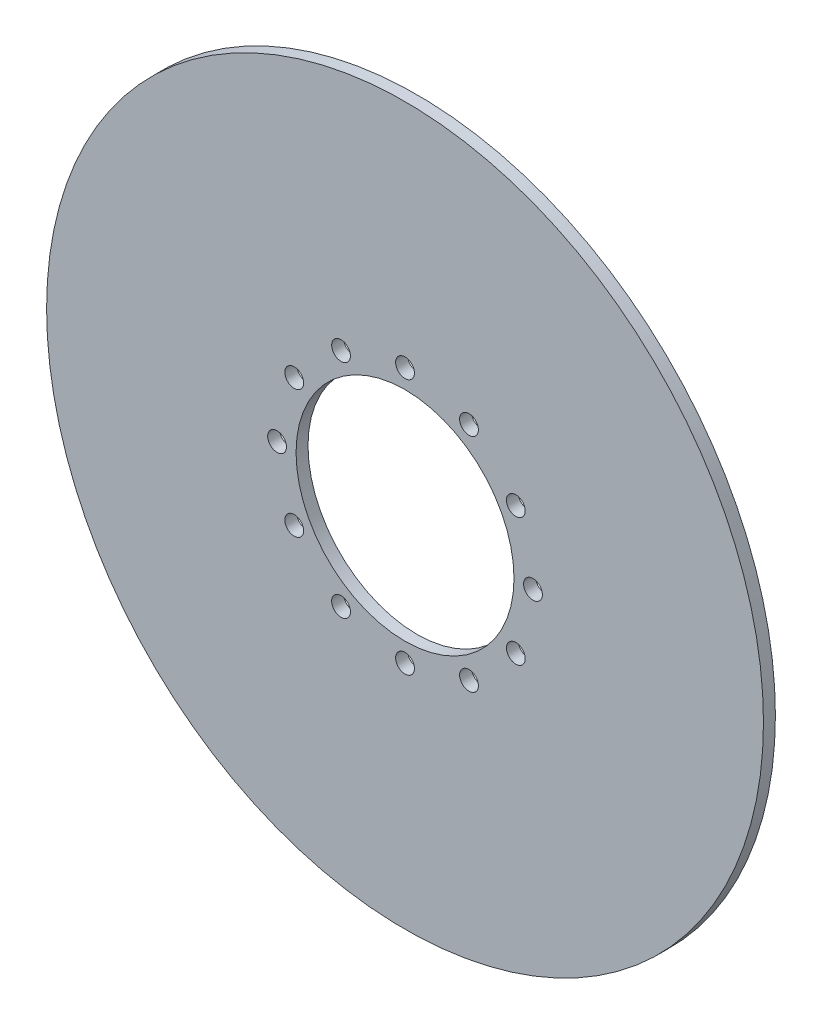
ISO-10303-21;
HEADER;
FILE_DESCRIPTION(('STEP AP214'),'2;1');
FILE_NAME('part.step','',(''),(''),'','','');
FILE_SCHEMA(('AUTOMOTIVE_DESIGN { 1 0 10303 214 1 1 1 1 }'));
ENDSEC;
DATA;
#1=APPLICATION_CONTEXT('core data for automotive mechanical design processes');
#2=APPLICATION_PROTOCOL_DEFINITION('international standard','automotive_design',2000,#1);
#3=PRODUCT_CONTEXT('',#1,'mechanical');
#4=PRODUCT('Part','Part','',(#3));
#5=PRODUCT_RELATED_PRODUCT_CATEGORY('part','',(#4));
#6=PRODUCT_DEFINITION_FORMATION('','',#4);
#7=PRODUCT_DEFINITION_CONTEXT('part definition',#1,'design');
#8=PRODUCT_DEFINITION('design','',#6,#7);
#9=PRODUCT_DEFINITION_SHAPE('','',#8);
#10=(LENGTH_UNIT() NAMED_UNIT(*) SI_UNIT(.MILLI.,.METRE.));
#11=(NAMED_UNIT(*) PLANE_ANGLE_UNIT() SI_UNIT($,.RADIAN.));
#12=(NAMED_UNIT(*) SI_UNIT($,.STERADIAN.) SOLID_ANGLE_UNIT());
#13=UNCERTAINTY_MEASURE_WITH_UNIT(LENGTH_MEASURE(1.E-05),#10,'distance_accuracy_value','');
#14=(GEOMETRIC_REPRESENTATION_CONTEXT(3) GLOBAL_UNCERTAINTY_ASSIGNED_CONTEXT((#13)) GLOBAL_UNIT_ASSIGNED_CONTEXT((#10,
#11,#12)) REPRESENTATION_CONTEXT('',''));
#15=CARTESIAN_POINT('',(0.,0.,0.));
#16=DIRECTION('',(0.,0.,1.));
#17=DIRECTION('',(1.,0.,0.));
#18=AXIS2_PLACEMENT_3D('',#15,#16,#17);
#19=CARTESIAN_POINT('',(0.,0.,3.175));
#20=DIRECTION('',(0.,0.,1.));
#21=DIRECTION('',(1.,0.,0.));
#22=AXIS2_PLACEMENT_3D('',#19,#20,#21);
#23=PLANE('',#22);
#24=CARTESIAN_POINT('',(-29.4448637286702,16.9999999999987,3.175));
#25=DIRECTION('',(0.,0.,1.));
#26=DIRECTION('',(1.,0.,0.));
#27=AXIS2_PLACEMENT_3D('',#24,#25,#26);
#28=CIRCLE('',#27,2.49698906987796);
#29=CARTESIAN_POINT('',(-26.9478746587923,16.9999999999987,3.175));
#30=VERTEX_POINT('',#29);
#31=EDGE_CURVE('E107',#30,#30,#28,.T.);
#32=ORIENTED_EDGE('',*,*,#31,.F.);
#33=EDGE_LOOP('',(#32));
#34=FACE_BOUND('',#33,.T.);
#35=CARTESIAN_POINT('',(-29.4448637286688,-17.0000000000013,3.175));
#36=DIRECTION('',(0.,0.,1.));
#37=DIRECTION('',(1.,0.,0.));
#38=AXIS2_PLACEMENT_3D('',#35,#36,#37);
#39=CIRCLE('',#38,2.49698906987796);
#40=CARTESIAN_POINT('',(-26.9478746587908,-17.0000000000013,3.175));
#41=VERTEX_POINT('',#40);
#42=EDGE_CURVE('E95',#41,#41,#39,.T.);
#43=ORIENTED_EDGE('',*,*,#42,.F.);
#44=EDGE_LOOP('',(#43));
#45=FACE_BOUND('',#44,.T.);
#46=CARTESIAN_POINT('',(2.86804195578331E-12,-34.,3.175));
#47=DIRECTION('',(0.,0.,1.));
#48=DIRECTION('',(1.,0.,0.));
#49=AXIS2_PLACEMENT_3D('',#46,#47,#48);
#50=CIRCLE('',#49,2.49698906987796);
#51=CARTESIAN_POINT('',(2.49698906988083,-34.,3.175));
#52=VERTEX_POINT('',#51);
#53=EDGE_CURVE('E83',#52,#52,#50,.T.);
#54=ORIENTED_EDGE('',*,*,#53,.F.);
#55=EDGE_LOOP('',(#54));
#56=FACE_BOUND('',#55,.T.);
#57=CARTESIAN_POINT('',(29.4448637286731,-16.9999999999988,3.175));
#58=DIRECTION('',(0.,0.,1.));
#59=DIRECTION('',(1.,0.,0.));
#60=AXIS2_PLACEMENT_3D('',#57,#58,#59);
#61=CIRCLE('',#60,2.49698906987769);
#62=CARTESIAN_POINT('',(31.9418527985508,-16.9999999999988,3.175));
#63=VERTEX_POINT('',#62);
#64=EDGE_CURVE('E71',#63,#63,#61,.T.);
#65=ORIENTED_EDGE('',*,*,#64,.F.);
#66=EDGE_LOOP('',(#65));
#67=FACE_BOUND('',#66,.T.);
#68=CARTESIAN_POINT('',(29.4448637286716,17.0000000000012,3.175));
#69=DIRECTION('',(0.,0.,1.));
#70=DIRECTION('',(1.,0.,0.));
#71=AXIS2_PLACEMENT_3D('',#68,#69,#70);
#72=CIRCLE('',#71,2.49698906987796);
#73=CARTESIAN_POINT('',(31.9418527985496,17.0000000000012,3.175));
#74=VERTEX_POINT('',#73);
#75=EDGE_CURVE('E59',#74,#74,#72,.T.);
#76=ORIENTED_EDGE('',*,*,#75,.F.);
#77=EDGE_LOOP('',(#76));
#78=FACE_BOUND('',#77,.T.);
#79=CARTESIAN_POINT('',(0.,34.,3.175));
#80=DIRECTION('',(0.,0.,1.));
#81=DIRECTION('',(1.,0.,0.));
#82=AXIS2_PLACEMENT_3D('',#79,#80,#81);
#83=CIRCLE('',#82,2.49698906987796);
#84=CARTESIAN_POINT('',(2.49698906987796,34.,3.175));
#85=VERTEX_POINT('',#84);
#86=EDGE_CURVE('E47',#85,#85,#83,.T.);
#87=ORIENTED_EDGE('',*,*,#86,.F.);
#88=EDGE_LOOP('',(#87));
#89=FACE_BOUND('',#88,.T.);
#90=CARTESIAN_POINT('',(0.,0.,3.175));
#91=DIRECTION('',(0.,0.,1.));
#92=DIRECTION('',(1.,0.,0.));
#93=AXIS2_PLACEMENT_3D('',#90,#91,#92);
#94=CIRCLE('',#93,95.25);
#95=CARTESIAN_POINT('',(95.25,0.,3.175));
#96=VERTEX_POINT('',#95);
#97=EDGE_CURVE('E10',#96,#96,#94,.T.);
#98=ORIENTED_EDGE('',*,*,#97,.T.);
#99=EDGE_LOOP('',(#98));
#100=FACE_BOUND('',#99,.T.);
#101=CARTESIAN_POINT('',(0.,0.,3.175));
#102=DIRECTION('',(0.,0.,1.));
#103=DIRECTION('',(1.,0.,0.));
#104=AXIS2_PLACEMENT_3D('',#101,#102,#103);
#105=CIRCLE('',#104,28.956);
#106=CARTESIAN_POINT('',(28.956,0.,3.175));
#107=VERTEX_POINT('',#106);
#108=EDGE_CURVE('E42',#107,#107,#105,.T.);
#109=ORIENTED_EDGE('',*,*,#108,.F.);
#110=EDGE_LOOP('',(#109));
#111=FACE_BOUND('',#110,.T.);
#112=CARTESIAN_POINT('',(17.0000000000002,29.4448637286716,3.175));
#113=DIRECTION('',(0.,0.,1.));
#114=DIRECTION('',(1.,0.,0.));
#115=AXIS2_PLACEMENT_3D('',#112,#113,#114);
#116=CIRCLE('',#115,2.49698906987796);
#117=CARTESIAN_POINT('',(19.4969890698782,29.4448637286716,3.175));
#118=VERTEX_POINT('',#117);
#119=EDGE_CURVE('E53',#118,#118,#116,.T.);
#120=ORIENTED_EDGE('',*,*,#119,.F.);
#121=EDGE_LOOP('',(#120));
#122=FACE_BOUND('',#121,.T.);
#123=CARTESIAN_POINT('',(34.0000000000014,1.43402097789165E-12,3.175));
#124=DIRECTION('',(0.,0.,1.));
#125=DIRECTION('',(1.,0.,0.));
#126=AXIS2_PLACEMENT_3D('',#123,#124,#125);
#127=CIRCLE('',#126,2.49698906987796);
#128=CARTESIAN_POINT('',(36.4969890698794,1.43402097789165E-12,3.175));
#129=VERTEX_POINT('',#128);
#130=EDGE_CURVE('E65',#129,#129,#127,.T.);
#131=ORIENTED_EDGE('',*,*,#130,.F.);
#132=EDGE_LOOP('',(#131));
#133=FACE_BOUND('',#132,.T.);
#134=CARTESIAN_POINT('',(17.0000000000027,-29.4448637286702,3.175));
#135=DIRECTION('',(0.,0.,1.));
#136=DIRECTION('',(1.,0.,0.));
#137=AXIS2_PLACEMENT_3D('',#134,#135,#136);
#138=CIRCLE('',#137,2.49698906987837);
#139=CARTESIAN_POINT('',(19.4969890698811,-29.4448637286702,3.175));
#140=VERTEX_POINT('',#139);
#141=EDGE_CURVE('E77',#140,#140,#138,.T.);
#142=ORIENTED_EDGE('',*,*,#141,.F.);
#143=EDGE_LOOP('',(#142));
#144=FACE_BOUND('',#143,.T.);
#145=CARTESIAN_POINT('',(-16.9999999999973,-29.4448637286716,3.175));
#146=DIRECTION('',(0.,0.,1.));
#147=DIRECTION('',(1.,0.,0.));
#148=AXIS2_PLACEMENT_3D('',#145,#146,#147);
#149=CIRCLE('',#148,2.49698906987796);
#150=CARTESIAN_POINT('',(-14.5030109301194,-29.4448637286716,3.175));
#151=VERTEX_POINT('',#150);
#152=EDGE_CURVE('E89',#151,#151,#149,.T.);
#153=ORIENTED_EDGE('',*,*,#152,.F.);
#154=EDGE_LOOP('',(#153));
#155=FACE_BOUND('',#154,.T.);
#156=CARTESIAN_POINT('',(-33.9999999999986,-1.43818477700875E-12,3.175));
#157=DIRECTION('',(0.,0.,1.));
#158=DIRECTION('',(1.,0.,0.));
#159=AXIS2_PLACEMENT_3D('',#156,#157,#158);
#160=CIRCLE('',#159,2.49698906987796);
#161=CARTESIAN_POINT('',(-31.5030109301206,-1.43818477700875E-12,3.175));
#162=VERTEX_POINT('',#161);
#163=EDGE_CURVE('E101',#162,#162,#160,.T.);
#164=ORIENTED_EDGE('',*,*,#163,.F.);
#165=EDGE_LOOP('',(#164));
#166=FACE_BOUND('',#165,.T.);
#167=CARTESIAN_POINT('',(-16.9999999999998,29.4448637286702,3.175));
#168=DIRECTION('',(0.,0.,1.));
#169=DIRECTION('',(1.,0.,0.));
#170=AXIS2_PLACEMENT_3D('',#167,#168,#169);
#171=CIRCLE('',#170,2.49698906987796);
#172=CARTESIAN_POINT('',(-14.5030109301219,29.4448637286702,3.175));
#173=VERTEX_POINT('',#172);
#174=EDGE_CURVE('E113',#173,#173,#171,.T.);
#175=ORIENTED_EDGE('',*,*,#174,.F.);
#176=EDGE_LOOP('',(#175));
#177=FACE_BOUND('',#176,.T.);
#178=ADVANCED_FACE('F31',(#34,#45,#56,#67,#78,#89,#100,#111,#122,#133,#144,#155,#166,#177),#23,.T.);
#179=CARTESIAN_POINT('',(0.,0.,0.));
#180=DIRECTION('',(0.,0.,1.));
#181=DIRECTION('',(1.,0.,0.));
#182=AXIS2_PLACEMENT_3D('',#179,#180,#181);
#183=PLANE('',#182);
#184=CARTESIAN_POINT('',(0.,0.,0.));
#185=DIRECTION('',(0.,0.,1.));
#186=DIRECTION('',(1.,0.,0.));
#187=AXIS2_PLACEMENT_3D('',#184,#185,#186);
#188=CIRCLE('',#187,95.25);
#189=CARTESIAN_POINT('',(95.25,0.,0.));
#190=VERTEX_POINT('',#189);
#191=EDGE_CURVE('E35',#190,#190,#188,.T.);
#192=ORIENTED_EDGE('',*,*,#191,.F.);
#193=EDGE_LOOP('',(#192));
#194=FACE_BOUND('',#193,.T.);
#195=CARTESIAN_POINT('',(0.,0.,0.));
#196=DIRECTION('',(0.,0.,1.));
#197=DIRECTION('',(1.,0.,0.));
#198=AXIS2_PLACEMENT_3D('',#195,#196,#197);
#199=CIRCLE('',#198,28.956);
#200=CARTESIAN_POINT('',(28.956,0.,0.));
#201=VERTEX_POINT('',#200);
#202=EDGE_CURVE('E44',#201,#201,#199,.T.);
#203=ORIENTED_EDGE('',*,*,#202,.T.);
#204=EDGE_LOOP('',(#203));
#205=FACE_BOUND('',#204,.T.);
#206=CARTESIAN_POINT('',(0.,34.,0.));
#207=DIRECTION('',(0.,0.,1.));
#208=DIRECTION('',(1.,0.,0.));
#209=AXIS2_PLACEMENT_3D('',#206,#207,#208);
#210=CIRCLE('',#209,2.49698906987796);
#211=CARTESIAN_POINT('',(2.49698906987796,34.,0.));
#212=VERTEX_POINT('',#211);
#213=EDGE_CURVE('E50',#212,#212,#210,.T.);
#214=ORIENTED_EDGE('',*,*,#213,.T.);
#215=EDGE_LOOP('',(#214));
#216=FACE_BOUND('',#215,.T.);
#217=CARTESIAN_POINT('',(17.0000000000002,29.4448637286716,0.));
#218=DIRECTION('',(0.,0.,1.));
#219=DIRECTION('',(1.,0.,0.));
#220=AXIS2_PLACEMENT_3D('',#217,#218,#219);
#221=CIRCLE('',#220,2.49698906987796);
#222=CARTESIAN_POINT('',(19.4969890698782,29.4448637286716,0.));
#223=VERTEX_POINT('',#222);
#224=EDGE_CURVE('E56',#223,#223,#221,.T.);
#225=ORIENTED_EDGE('',*,*,#224,.T.);
#226=EDGE_LOOP('',(#225));
#227=FACE_BOUND('',#226,.T.);
#228=CARTESIAN_POINT('',(29.4448637286716,17.0000000000012,0.));
#229=DIRECTION('',(0.,0.,1.));
#230=DIRECTION('',(1.,0.,0.));
#231=AXIS2_PLACEMENT_3D('',#228,#229,#230);
#232=CIRCLE('',#231,2.49698906987796);
#233=CARTESIAN_POINT('',(31.9418527985496,17.0000000000012,0.));
#234=VERTEX_POINT('',#233);
#235=EDGE_CURVE('E62',#234,#234,#232,.T.);
#236=ORIENTED_EDGE('',*,*,#235,.T.);
#237=EDGE_LOOP('',(#236));
#238=FACE_BOUND('',#237,.T.);
#239=CARTESIAN_POINT('',(34.0000000000014,1.43402097789165E-12,0.));
#240=DIRECTION('',(0.,0.,1.));
#241=DIRECTION('',(1.,0.,0.));
#242=AXIS2_PLACEMENT_3D('',#239,#240,#241);
#243=CIRCLE('',#242,2.49698906987796);
#244=CARTESIAN_POINT('',(36.4969890698794,1.43402097789165E-12,0.));
#245=VERTEX_POINT('',#244);
#246=EDGE_CURVE('E68',#245,#245,#243,.T.);
#247=ORIENTED_EDGE('',*,*,#246,.T.);
#248=EDGE_LOOP('',(#247));
#249=FACE_BOUND('',#248,.T.);
#250=CARTESIAN_POINT('',(29.4448637286731,-16.9999999999988,0.));
#251=DIRECTION('',(0.,0.,1.));
#252=DIRECTION('',(1.,0.,0.));
#253=AXIS2_PLACEMENT_3D('',#250,#251,#252);
#254=CIRCLE('',#253,2.49698906987769);
#255=CARTESIAN_POINT('',(31.9418527985508,-16.9999999999988,0.));
#256=VERTEX_POINT('',#255);
#257=EDGE_CURVE('E74',#256,#256,#254,.T.);
#258=ORIENTED_EDGE('',*,*,#257,.T.);
#259=EDGE_LOOP('',(#258));
#260=FACE_BOUND('',#259,.T.);
#261=CARTESIAN_POINT('',(17.0000000000027,-29.4448637286702,0.));
#262=DIRECTION('',(0.,0.,1.));
#263=DIRECTION('',(1.,0.,0.));
#264=AXIS2_PLACEMENT_3D('',#261,#262,#263);
#265=CIRCLE('',#264,2.49698906987837);
#266=CARTESIAN_POINT('',(19.4969890698811,-29.4448637286702,0.));
#267=VERTEX_POINT('',#266);
#268=EDGE_CURVE('E80',#267,#267,#265,.T.);
#269=ORIENTED_EDGE('',*,*,#268,.T.);
#270=EDGE_LOOP('',(#269));
#271=FACE_BOUND('',#270,.T.);
#272=CARTESIAN_POINT('',(2.86804195578331E-12,-34.,0.));
#273=DIRECTION('',(0.,0.,1.));
#274=DIRECTION('',(1.,0.,0.));
#275=AXIS2_PLACEMENT_3D('',#272,#273,#274);
#276=CIRCLE('',#275,2.49698906987796);
#277=CARTESIAN_POINT('',(2.49698906988083,-34.,0.));
#278=VERTEX_POINT('',#277);
#279=EDGE_CURVE('E86',#278,#278,#276,.T.);
#280=ORIENTED_EDGE('',*,*,#279,.T.);
#281=EDGE_LOOP('',(#280));
#282=FACE_BOUND('',#281,.T.);
#283=CARTESIAN_POINT('',(-16.9999999999973,-29.4448637286716,0.));
#284=DIRECTION('',(0.,0.,1.));
#285=DIRECTION('',(1.,0.,0.));
#286=AXIS2_PLACEMENT_3D('',#283,#284,#285);
#287=CIRCLE('',#286,2.49698906987796);
#288=CARTESIAN_POINT('',(-14.5030109301194,-29.4448637286716,0.));
#289=VERTEX_POINT('',#288);
#290=EDGE_CURVE('E92',#289,#289,#287,.T.);
#291=ORIENTED_EDGE('',*,*,#290,.T.);
#292=EDGE_LOOP('',(#291));
#293=FACE_BOUND('',#292,.T.);
#294=CARTESIAN_POINT('',(-29.4448637286688,-17.0000000000013,0.));
#295=DIRECTION('',(0.,0.,1.));
#296=DIRECTION('',(1.,0.,0.));
#297=AXIS2_PLACEMENT_3D('',#294,#295,#296);
#298=CIRCLE('',#297,2.49698906987796);
#299=CARTESIAN_POINT('',(-26.9478746587908,-17.0000000000013,0.));
#300=VERTEX_POINT('',#299);
#301=EDGE_CURVE('E98',#300,#300,#298,.T.);
#302=ORIENTED_EDGE('',*,*,#301,.T.);
#303=EDGE_LOOP('',(#302));
#304=FACE_BOUND('',#303,.T.);
#305=CARTESIAN_POINT('',(-33.9999999999986,-1.43818477700875E-12,0.));
#306=DIRECTION('',(0.,0.,1.));
#307=DIRECTION('',(1.,0.,0.));
#308=AXIS2_PLACEMENT_3D('',#305,#306,#307);
#309=CIRCLE('',#308,2.49698906987796);
#310=CARTESIAN_POINT('',(-31.5030109301206,-1.43818477700875E-12,0.));
#311=VERTEX_POINT('',#310);
#312=EDGE_CURVE('E104',#311,#311,#309,.T.);
#313=ORIENTED_EDGE('',*,*,#312,.T.);
#314=EDGE_LOOP('',(#313));
#315=FACE_BOUND('',#314,.T.);
#316=CARTESIAN_POINT('',(-29.4448637286702,16.9999999999987,0.));
#317=DIRECTION('',(0.,0.,1.));
#318=DIRECTION('',(1.,0.,0.));
#319=AXIS2_PLACEMENT_3D('',#316,#317,#318);
#320=CIRCLE('',#319,2.49698906987796);
#321=CARTESIAN_POINT('',(-26.9478746587923,16.9999999999987,0.));
#322=VERTEX_POINT('',#321);
#323=EDGE_CURVE('E110',#322,#322,#320,.T.);
#324=ORIENTED_EDGE('',*,*,#323,.T.);
#325=EDGE_LOOP('',(#324));
#326=FACE_BOUND('',#325,.T.);
#327=CARTESIAN_POINT('',(-16.9999999999998,29.4448637286702,0.));
#328=DIRECTION('',(0.,0.,1.));
#329=DIRECTION('',(1.,0.,0.));
#330=AXIS2_PLACEMENT_3D('',#327,#328,#329);
#331=CIRCLE('',#330,2.49698906987796);
#332=CARTESIAN_POINT('',(-14.5030109301219,29.4448637286702,0.));
#333=VERTEX_POINT('',#332);
#334=EDGE_CURVE('E116',#333,#333,#331,.T.);
#335=ORIENTED_EDGE('',*,*,#334,.T.);
#336=EDGE_LOOP('',(#335));
#337=FACE_BOUND('',#336,.T.);
#338=ADVANCED_FACE('F126',(#194,#205,#216,#227,#238,#249,#260,#271,#282,#293,#304,#315,#326,
#337),#183,.F.);
#339=CARTESIAN_POINT('',(0.,0.,3.175));
#340=DIRECTION('',(0.,0.,-1.));
#341=DIRECTION('',(-1.,0.,0.));
#342=AXIS2_PLACEMENT_3D('',#339,#340,#341);
#343=CYLINDRICAL_SURFACE('',#342,95.25);
#344=ORIENTED_EDGE('',*,*,#97,.F.);
#345=EDGE_LOOP('',(#344));
#346=FACE_BOUND('',#345,.T.);
#347=ORIENTED_EDGE('',*,*,#191,.T.);
#348=EDGE_LOOP('',(#347));
#349=FACE_BOUND('',#348,.T.);
#350=ADVANCED_FACE('F33',(#346,#349),#343,.T.);
#351=CARTESIAN_POINT('',(0.,0.,3.175));
#352=DIRECTION('',(0.,0.,-1.));
#353=DIRECTION('',(-1.,0.,0.));
#354=AXIS2_PLACEMENT_3D('',#351,#352,#353);
#355=CYLINDRICAL_SURFACE('',#354,28.956);
#356=ORIENTED_EDGE('',*,*,#108,.T.);
#357=EDGE_LOOP('',(#356));
#358=FACE_BOUND('',#357,.T.);
#359=ORIENTED_EDGE('',*,*,#202,.F.);
#360=EDGE_LOOP('',(#359));
#361=FACE_BOUND('',#360,.T.);
#362=ADVANCED_FACE('F136',(#358,#361),#355,.F.);
#363=CARTESIAN_POINT('',(0.,34.,3.175));
#364=DIRECTION('',(0.,0.,-1.));
#365=DIRECTION('',(-1.,0.,0.));
#366=AXIS2_PLACEMENT_3D('',#363,#364,#365);
#367=CYLINDRICAL_SURFACE('',#366,2.49698906987796);
#368=ORIENTED_EDGE('',*,*,#86,.T.);
#369=EDGE_LOOP('',(#368));
#370=FACE_BOUND('',#369,.T.);
#371=ORIENTED_EDGE('',*,*,#213,.F.);
#372=EDGE_LOOP('',(#371));
#373=FACE_BOUND('',#372,.T.);
#374=ADVANCED_FACE('F139',(#370,#373),#367,.F.);
#375=CARTESIAN_POINT('',(17.0000000000002,29.4448637286716,3.175));
#376=DIRECTION('',(0.,0.,-1.));
#377=DIRECTION('',(-1.,0.,0.));
#378=AXIS2_PLACEMENT_3D('',#375,#376,#377);
#379=CYLINDRICAL_SURFACE('',#378,2.49698906987796);
#380=ORIENTED_EDGE('',*,*,#119,.T.);
#381=EDGE_LOOP('',(#380));
#382=FACE_BOUND('',#381,.T.);
#383=ORIENTED_EDGE('',*,*,#224,.F.);
#384=EDGE_LOOP('',(#383));
#385=FACE_BOUND('',#384,.T.);
#386=ADVANCED_FACE('F143',(#382,#385),#379,.F.);
#387=CARTESIAN_POINT('',(29.4448637286716,17.0000000000012,3.175));
#388=DIRECTION('',(0.,0.,-1.));
#389=DIRECTION('',(-1.,0.,0.));
#390=AXIS2_PLACEMENT_3D('',#387,#388,#389);
#391=CYLINDRICAL_SURFACE('',#390,2.49698906987796);
#392=ORIENTED_EDGE('',*,*,#75,.T.);
#393=EDGE_LOOP('',(#392));
#394=FACE_BOUND('',#393,.T.);
#395=ORIENTED_EDGE('',*,*,#235,.F.);
#396=EDGE_LOOP('',(#395));
#397=FACE_BOUND('',#396,.T.);
#398=ADVANCED_FACE('F147',(#394,#397),#391,.F.);
#399=CARTESIAN_POINT('',(34.0000000000014,1.43402097789165E-12,3.175));
#400=DIRECTION('',(0.,0.,-1.));
#401=DIRECTION('',(-1.,0.,0.));
#402=AXIS2_PLACEMENT_3D('',#399,#400,#401);
#403=CYLINDRICAL_SURFACE('',#402,2.49698906987796);
#404=ORIENTED_EDGE('',*,*,#130,.T.);
#405=EDGE_LOOP('',(#404));
#406=FACE_BOUND('',#405,.T.);
#407=ORIENTED_EDGE('',*,*,#246,.F.);
#408=EDGE_LOOP('',(#407));
#409=FACE_BOUND('',#408,.T.);
#410=ADVANCED_FACE('F151',(#406,#409),#403,.F.);
#411=CARTESIAN_POINT('',(29.4448637286731,-16.9999999999988,3.175));
#412=DIRECTION('',(0.,0.,-1.));
#413=DIRECTION('',(-1.,0.,0.));
#414=AXIS2_PLACEMENT_3D('',#411,#412,#413);
#415=CYLINDRICAL_SURFACE('',#414,2.49698906987769);
#416=ORIENTED_EDGE('',*,*,#64,.T.);
#417=EDGE_LOOP('',(#416));
#418=FACE_BOUND('',#417,.T.);
#419=ORIENTED_EDGE('',*,*,#257,.F.);
#420=EDGE_LOOP('',(#419));
#421=FACE_BOUND('',#420,.T.);
#422=ADVANCED_FACE('F155',(#418,#421),#415,.F.);
#423=CARTESIAN_POINT('',(17.0000000000027,-29.4448637286702,3.175));
#424=DIRECTION('',(0.,0.,-1.));
#425=DIRECTION('',(-1.,0.,0.));
#426=AXIS2_PLACEMENT_3D('',#423,#424,#425);
#427=CYLINDRICAL_SURFACE('',#426,2.49698906987837);
#428=ORIENTED_EDGE('',*,*,#141,.T.);
#429=EDGE_LOOP('',(#428));
#430=FACE_BOUND('',#429,.T.);
#431=ORIENTED_EDGE('',*,*,#268,.F.);
#432=EDGE_LOOP('',(#431));
#433=FACE_BOUND('',#432,.T.);
#434=ADVANCED_FACE('F159',(#430,#433),#427,.F.);
#435=CARTESIAN_POINT('',(2.86804195578331E-12,-34.,3.175));
#436=DIRECTION('',(0.,0.,-1.));
#437=DIRECTION('',(-1.,0.,0.));
#438=AXIS2_PLACEMENT_3D('',#435,#436,#437);
#439=CYLINDRICAL_SURFACE('',#438,2.49698906987796);
#440=ORIENTED_EDGE('',*,*,#53,.T.);
#441=EDGE_LOOP('',(#440));
#442=FACE_BOUND('',#441,.T.);
#443=ORIENTED_EDGE('',*,*,#279,.F.);
#444=EDGE_LOOP('',(#443));
#445=FACE_BOUND('',#444,.T.);
#446=ADVANCED_FACE('F163',(#442,#445),#439,.F.);
#447=CARTESIAN_POINT('',(-16.9999999999973,-29.4448637286716,3.175));
#448=DIRECTION('',(0.,0.,-1.));
#449=DIRECTION('',(-1.,0.,0.));
#450=AXIS2_PLACEMENT_3D('',#447,#448,#449);
#451=CYLINDRICAL_SURFACE('',#450,2.49698906987796);
#452=ORIENTED_EDGE('',*,*,#152,.T.);
#453=EDGE_LOOP('',(#452));
#454=FACE_BOUND('',#453,.T.);
#455=ORIENTED_EDGE('',*,*,#290,.F.);
#456=EDGE_LOOP('',(#455));
#457=FACE_BOUND('',#456,.T.);
#458=ADVANCED_FACE('F167',(#454,#457),#451,.F.);
#459=CARTESIAN_POINT('',(-29.4448637286688,-17.0000000000013,3.175));
#460=DIRECTION('',(0.,0.,-1.));
#461=DIRECTION('',(-1.,0.,0.));
#462=AXIS2_PLACEMENT_3D('',#459,#460,#461);
#463=CYLINDRICAL_SURFACE('',#462,2.49698906987796);
#464=ORIENTED_EDGE('',*,*,#42,.T.);
#465=EDGE_LOOP('',(#464));
#466=FACE_BOUND('',#465,.T.);
#467=ORIENTED_EDGE('',*,*,#301,.F.);
#468=EDGE_LOOP('',(#467));
#469=FACE_BOUND('',#468,.T.);
#470=ADVANCED_FACE('F171',(#466,#469),#463,.F.);
#471=CARTESIAN_POINT('',(-33.9999999999986,-1.43818477700875E-12,3.175));
#472=DIRECTION('',(0.,0.,-1.));
#473=DIRECTION('',(-1.,0.,0.));
#474=AXIS2_PLACEMENT_3D('',#471,#472,#473);
#475=CYLINDRICAL_SURFACE('',#474,2.49698906987796);
#476=ORIENTED_EDGE('',*,*,#163,.T.);
#477=EDGE_LOOP('',(#476));
#478=FACE_BOUND('',#477,.T.);
#479=ORIENTED_EDGE('',*,*,#312,.F.);
#480=EDGE_LOOP('',(#479));
#481=FACE_BOUND('',#480,.T.);
#482=ADVANCED_FACE('F175',(#478,#481),#475,.F.);
#483=CARTESIAN_POINT('',(-29.4448637286702,16.9999999999987,3.175));
#484=DIRECTION('',(0.,0.,-1.));
#485=DIRECTION('',(-1.,0.,0.));
#486=AXIS2_PLACEMENT_3D('',#483,#484,#485);
#487=CYLINDRICAL_SURFACE('',#486,2.49698906987796);
#488=ORIENTED_EDGE('',*,*,#31,.T.);
#489=EDGE_LOOP('',(#488));
#490=FACE_BOUND('',#489,.T.);
#491=ORIENTED_EDGE('',*,*,#323,.F.);
#492=EDGE_LOOP('',(#491));
#493=FACE_BOUND('',#492,.T.);
#494=ADVANCED_FACE('F179',(#490,#493),#487,.F.);
#495=CARTESIAN_POINT('',(-16.9999999999998,29.4448637286702,3.175));
#496=DIRECTION('',(0.,0.,-1.));
#497=DIRECTION('',(-1.,0.,0.));
#498=AXIS2_PLACEMENT_3D('',#495,#496,#497);
#499=CYLINDRICAL_SURFACE('',#498,2.49698906987796);
#500=ORIENTED_EDGE('',*,*,#174,.T.);
#501=EDGE_LOOP('',(#500));
#502=FACE_BOUND('',#501,.T.);
#503=ORIENTED_EDGE('',*,*,#334,.F.);
#504=EDGE_LOOP('',(#503));
#505=FACE_BOUND('',#504,.T.);
#506=ADVANCED_FACE('F122',(#502,#505),#499,.F.);
#507=CLOSED_SHELL('',(#178,#338,#350,#362,#374,#386,#398,#410,#422,#434,#446,#458,#470,#482,
#494,#506));
#508=MANIFOLD_SOLID_BREP('B2',#507);
#509=ADVANCED_BREP_SHAPE_REPRESENTATION('',(#18,#508),#14);
#510=SHAPE_DEFINITION_REPRESENTATION(#9,#509);
ENDSEC;
END-ISO-10303-21;
